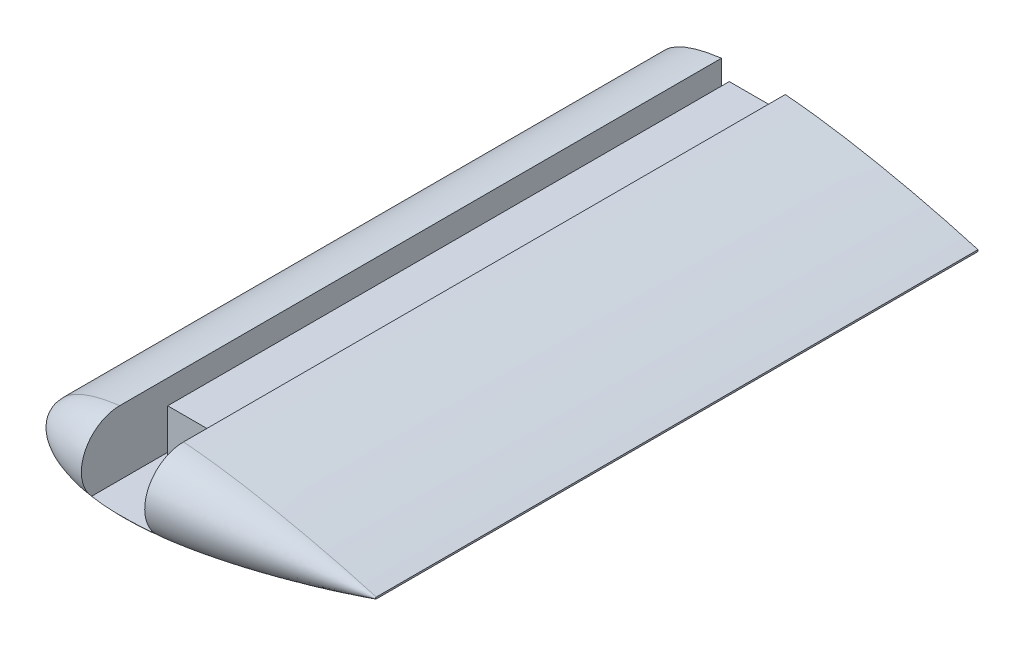
ISO-10303-21;
HEADER;
FILE_DESCRIPTION(('STEP AP214'),'2;1');
FILE_NAME('part.step','',(''),(''),'','','');
FILE_SCHEMA(('AUTOMOTIVE_DESIGN { 1 0 10303 214 1 1 1 1 }'));
ENDSEC;
DATA;
#1=APPLICATION_CONTEXT('core data for automotive mechanical design processes');
#2=APPLICATION_PROTOCOL_DEFINITION('international standard','automotive_design',2000,#1);
#3=PRODUCT_CONTEXT('',#1,'mechanical');
#4=PRODUCT('Part','Part','',(#3));
#5=PRODUCT_RELATED_PRODUCT_CATEGORY('part','',(#4));
#6=PRODUCT_DEFINITION_FORMATION('','',#4);
#7=PRODUCT_DEFINITION_CONTEXT('part definition',#1,'design');
#8=PRODUCT_DEFINITION('design','',#6,#7);
#9=PRODUCT_DEFINITION_SHAPE('','',#8);
#10=(LENGTH_UNIT() NAMED_UNIT(*) SI_UNIT(.MILLI.,.METRE.));
#11=(NAMED_UNIT(*) PLANE_ANGLE_UNIT() SI_UNIT($,.RADIAN.));
#12=(NAMED_UNIT(*) SI_UNIT($,.STERADIAN.) SOLID_ANGLE_UNIT());
#13=UNCERTAINTY_MEASURE_WITH_UNIT(LENGTH_MEASURE(1.E-05),#10,'distance_accuracy_value','');
#14=(GEOMETRIC_REPRESENTATION_CONTEXT(3) GLOBAL_UNCERTAINTY_ASSIGNED_CONTEXT((#13)) GLOBAL_UNIT_ASSIGNED_CONTEXT((#10,
#11,#12)) REPRESENTATION_CONTEXT('',''));
#15=CARTESIAN_POINT('',(0.,0.,0.));
#16=DIRECTION('',(0.,0.,1.));
#17=DIRECTION('',(1.,0.,0.));
#18=AXIS2_PLACEMENT_3D('',#15,#16,#17);
#19=CARTESIAN_POINT('',(-6.,-6.49999999999986,160.023665725905));
#20=DIRECTION('',(1.,0.,0.));
#21=DIRECTION('',(0.,1.,0.));
#22=AXIS2_PLACEMENT_3D('',#19,#20,#21);
#23=PLANE('',#22);
#24=DIRECTION('',(0.,1.,0.));
#25=VECTOR('',#24,1.);
#26=CARTESIAN_POINT('',(-6.,0.,140.));
#27=LINE('',#26,#25);
#28=CARTESIAN_POINT('',(-6.,-6.49999999999986,140.));
#29=VERTEX_POINT('',#28);
#30=CARTESIAN_POINT('',(-6.,5.50000000000014,140.));
#31=VERTEX_POINT('',#30);
#32=EDGE_CURVE('E142',#29,#31,#27,.T.);
#33=ORIENTED_EDGE('',*,*,#32,.T.);
#34=DIRECTION('',(0.,0.,-1.));
#35=VECTOR('',#34,1.);
#36=CARTESIAN_POINT('',(-6.,5.50000000000014,160.023665725905));
#37=LINE('',#36,#35);
#38=CARTESIAN_POINT('',(-6.,5.50000000000014,0.));
#39=VERTEX_POINT('',#38);
#40=EDGE_CURVE('E141',#31,#39,#37,.T.);
#41=ORIENTED_EDGE('',*,*,#40,.T.);
#42=DIRECTION('',(0.,-1.,0.));
#43=VECTOR('',#42,1.);
#44=CARTESIAN_POINT('',(-6.,-6.49999999999986,0.));
#45=LINE('',#44,#43);
#46=CARTESIAN_POINT('',(-6.,-6.49999999999986,0.));
#47=VERTEX_POINT('',#46);
#48=EDGE_CURVE('E276',#39,#47,#45,.T.);
#49=ORIENTED_EDGE('',*,*,#48,.T.);
#50=DIRECTION('',(0.,0.,-1.));
#51=VECTOR('',#50,1.);
#52=CARTESIAN_POINT('',(-6.,-6.49999999999986,160.023665725905));
#53=LINE('',#52,#51);
#54=EDGE_CURVE('E161',#29,#47,#53,.T.);
#55=ORIENTED_EDGE('',*,*,#54,.F.);
#56=EDGE_LOOP('',(#33,#41,#49,#55));
#57=FACE_BOUND('',#56,.T.);
#58=ADVANCED_FACE('F41',(#57),#23,.F.);
#59=CARTESIAN_POINT('',(6.,5.50000000000014,160.023665725905));
#60=DIRECTION('',(0.,-1.,0.));
#61=DIRECTION('',(1.,0.,0.));
#62=AXIS2_PLACEMENT_3D('',#59,#60,#61);
#63=PLANE('',#62);
#64=DIRECTION('',(1.,0.,0.));
#65=VECTOR('',#64,1.);
#66=CARTESIAN_POINT('',(0.,5.50000000000014,140.));
#67=LINE('',#66,#65);
#68=CARTESIAN_POINT('',(6.,5.50000000000014,140.));
#69=VERTEX_POINT('',#68);
#70=EDGE_CURVE('E130',#31,#69,#67,.T.);
#71=ORIENTED_EDGE('',*,*,#70,.T.);
#72=DIRECTION('',(0.,0.,-1.));
#73=VECTOR('',#72,1.);
#74=CARTESIAN_POINT('',(6.,5.50000000000014,160.023665725905));
#75=LINE('',#74,#73);
#76=CARTESIAN_POINT('',(6.,5.50000000000014,0.));
#77=VERTEX_POINT('',#76);
#78=EDGE_CURVE('E139',#69,#77,#75,.T.);
#79=ORIENTED_EDGE('',*,*,#78,.T.);
#80=DIRECTION('',(-1.,0.,0.));
#81=VECTOR('',#80,1.);
#82=CARTESIAN_POINT('',(6.,5.50000000000014,0.));
#83=LINE('',#82,#81);
#84=EDGE_CURVE('E163',#77,#39,#83,.T.);
#85=ORIENTED_EDGE('',*,*,#84,.T.);
#86=ORIENTED_EDGE('',*,*,#40,.F.);
#87=EDGE_LOOP('',(#71,#79,#85,#86));
#88=FACE_BOUND('',#87,.T.);
#89=ADVANCED_FACE('F137',(#88),#63,.F.);
#90=CARTESIAN_POINT('',(6.,-6.49999999999986,160.023665725905));
#91=DIRECTION('',(-1.,0.,0.));
#92=DIRECTION('',(0.,-1.,0.));
#93=AXIS2_PLACEMENT_3D('',#90,#91,#92);
#94=PLANE('',#93);
#95=DIRECTION('',(0.,-1.,0.));
#96=VECTOR('',#95,1.);
#97=CARTESIAN_POINT('',(6.,0.,140.));
#98=LINE('',#97,#96);
#99=CARTESIAN_POINT('',(6.,-6.49999999999986,140.));
#100=VERTEX_POINT('',#99);
#101=EDGE_CURVE('E127',#69,#100,#98,.T.);
#102=ORIENTED_EDGE('',*,*,#101,.T.);
#103=DIRECTION('',(0.,0.,-1.));
#104=VECTOR('',#103,1.);
#105=CARTESIAN_POINT('',(6.,-6.49999999999986,160.023665725905));
#106=LINE('',#105,#104);
#107=CARTESIAN_POINT('',(6.,-6.49999999999986,0.));
#108=VERTEX_POINT('',#107);
#109=EDGE_CURVE('E148',#100,#108,#106,.T.);
#110=ORIENTED_EDGE('',*,*,#109,.T.);
#111=DIRECTION('',(0.,1.,0.));
#112=VECTOR('',#111,1.);
#113=CARTESIAN_POINT('',(6.,-6.49999999999986,0.));
#114=LINE('',#113,#112);
#115=EDGE_CURVE('E146',#108,#77,#114,.T.);
#116=ORIENTED_EDGE('',*,*,#115,.T.);
#117=ORIENTED_EDGE('',*,*,#78,.F.);
#118=EDGE_LOOP('',(#102,#110,#116,#117));
#119=FACE_BOUND('',#118,.T.);
#120=ADVANCED_FACE('F144',(#119),#94,.F.);
#121=CARTESIAN_POINT('',(55.9989919193493,0.209938863085076,150.));
#122=CARTESIAN_POINT('',(53.4638964966378,0.950455213569446,150.));
#123=CARTESIAN_POINT('',(48.8039042583549,2.23387389684317,150.));
#124=CARTESIAN_POINT('',(42.4289239083546,3.81993488404164,150.));
#125=CARTESIAN_POINT('',(36.7433768309172,5.12087345257297,150.));
#126=CARTESIAN_POINT('',(31.199749361999,6.28724939568446,150.));
#127=CARTESIAN_POINT('',(25.282426202672,7.40748841907212,150.));
#128=CARTESIAN_POINT('',(20.1764843732921,8.24523101459941,150.));
#129=CARTESIAN_POINT('',(14.9796239544358,8.97488730570402,150.));
#130=CARTESIAN_POINT('',(10.821499068855,9.448623319597,150.));
#131=CARTESIAN_POINT('',(6.69735098701538,9.77702289368401,150.));
#132=CARTESIAN_POINT('',(3.68065560441313,9.9396226054484,150.));
#133=CARTESIAN_POINT('',(0.739619612666901,10.0126657259053,150.));
#134=CARTESIAN_POINT('',(-2.10775121270018,9.99002894364164,150.));
#135=CARTESIAN_POINT('',(-4.84394170477697,9.86696098204471,150.));
#136=CARTESIAN_POINT('',(-7.45218804783977,9.64089989695852,150.));
#137=CARTESIAN_POINT('',(-9.91647870541163,9.31063074400066,150.));
#138=CARTESIAN_POINT('',(-12.2217517660549,8.87722299298465,150.));
#139=CARTESIAN_POINT('',(-14.3540217517739,8.3436594333454,150.));
#140=CARTESIAN_POINT('',(-16.3004013447247,7.71434115945919,150.));
#141=CARTESIAN_POINT('',(-18.0493555178327,6.99539951409285,150.));
#142=CARTESIAN_POINT('',(-19.5906051636423,6.19339349001841,150.));
#143=CARTESIAN_POINT('',(-20.9154102376862,5.31556202706807,150.));
#144=CARTESIAN_POINT('',(-22.0158536973899,4.36806482887196,150.));
#145=CARTESIAN_POINT('',(-22.8849211839651,3.3564916522408,150.));
#146=CARTESIAN_POINT('',(-23.5144514570847,2.28497610959955,150.));
#147=CARTESIAN_POINT('',(-23.8953726240987,1.15878899111641,150.));
#148=CARTESIAN_POINT('',(-24.0186796636969,-1.75908521777257E-13,150.));
#149=CARTESIAN_POINT('',(-23.8953726240988,-1.15878899111675,150.));
#150=CARTESIAN_POINT('',(-23.5144514570847,-2.28497610959989,150.));
#151=CARTESIAN_POINT('',(-22.884921183965,-3.35649165224111,150.));
#152=CARTESIAN_POINT('',(-22.0158536973898,-4.36806482887224,150.));
#153=CARTESIAN_POINT('',(-20.915410237686,-5.3155620270683,150.));
#154=CARTESIAN_POINT('',(-19.5906051636421,-6.19339349001866,150.));
#155=CARTESIAN_POINT('',(-18.0493555178326,-6.99539951409303,150.));
#156=CARTESIAN_POINT('',(-16.3004013447245,-7.7143411594593,150.));
#157=CARTESIAN_POINT('',(-14.3540217517738,-8.34365943334548,150.));
#158=CARTESIAN_POINT('',(-12.2217517660546,-8.87722299298468,150.));
#159=CARTESIAN_POINT('',(-9.91647870541153,-9.31063074400058,150.));
#160=CARTESIAN_POINT('',(-7.45218804783928,-9.64089989695837,150.));
#161=CARTESIAN_POINT('',(-4.84394170477671,-9.86696098204449,150.));
#162=CARTESIAN_POINT('',(-2.10775121269992,-9.9900289436414,150.));
#163=CARTESIAN_POINT('',(0.739619612667124,-10.0126657259049,150.));
#164=CARTESIAN_POINT('',(3.68065560441341,-9.93962260544802,150.));
#165=CARTESIAN_POINT('',(7.74070186985012,-9.72078633967261,150.));
#166=CARTESIAN_POINT('',(12.9128329822487,-9.24133423758695,150.));
#167=CARTESIAN_POINT('',(19.1366713132933,-8.41575446947586,150.));
#168=CARTESIAN_POINT('',(25.2824253698515,-7.40744897655412,150.));
#169=CARTESIAN_POINT('',(31.1997526672966,-6.28725230429911,150.));
#170=CARTESIAN_POINT('',(37.5171609466784,-4.95809921986488,150.));
#171=CARTESIAN_POINT('',(44.7425708724751,-3.27585727198836,150.));
#172=CARTESIAN_POINT('',(51.057566094569,-1.62626062854624,150.));
#173=CARTESIAN_POINT('',(54.9450257220016,-0.517808616230064,150.));
#174=CARTESIAN_POINT('',(55.9579115196256,-0.221938690548135,150.));
#175=CARTESIAN_POINT('',(55.9989919193493,-0.209938863083146,150.));
#176=B_SPLINE_CURVE_WITH_KNOTS('',3,(#121,#122,#123,#124,#125,#126,#127,#128,#129,#130,#131,
#132,#133,#134,#135,#136,#137,#138,#139,#140,#141,#142,#143,#144,#145,#146,#147,#148,#149,#150,
#151,#152,#153,#154,#155,#156,#157,#158,#159,#160,#161,#162,#163,#164,#165,#166,#167,#168,#169,
#170,#171,#172,#173,#174,#175),.UNSPECIFIED.,.F.,.F.,(4,1,1,1,1,1,1,1,1,1,1,1,1,1,1,1,1,1,1,1,1,
1,1,1,1,1,1,1,1,1,1,1,1,1,1,1,1,1,1,1,1,1,1,1,1,1,1,1,1,1,1,1,4),(0.,0.046554702548103,
0.0851933723553801,0.115793222339596,0.149362634078918,0.1850479898127,0.221946042476896,
0.240561294663547,0.277549679499533,0.295701184971201,0.313482549842361,0.330796889450606,
0.347551895237421,0.36366584186233,0.379065349030513,0.393686065347915,0.407475418245897,
0.42039193375361,0.432405656844922,0.443502805927447,0.45368642125852,0.462984388050073,
0.471455944432899,0.479204464756735,0.48638826860332,0.493228973887645,0.5,0.506771026112355,
0.51361173139668,0.520795535243265,0.528544055567101,0.537015611949927,0.54631357874148,
0.556497194072553,0.567594343155078,0.579608066246389,0.592524581754103,0.606313934652085,
0.620934650969486,0.63633415813767,0.652448104762579,0.669203110549394,0.686517450157639,
0.704298815028799,0.740866340835607,0.778053957523103,0.8149520101873,0.850637365921082,
0.884206777660403,0.928744289385696,0.981399281225805,0.999245596133163,1.),.UNSPECIFIED.);
#177=DIRECTION('',(0.,0.,-1.));
#178=VECTOR('',#177,1.);
#179=SURFACE_OF_LINEAR_EXTRUSION('',#176,#178);
#180=CARTESIAN_POINT('',(55.9989919193493,0.209938863085076,0.));
#181=CARTESIAN_POINT('',(53.4638964966378,0.950455213569446,0.));
#182=CARTESIAN_POINT('',(48.8039042583549,2.23387389684317,0.));
#183=CARTESIAN_POINT('',(42.4289239083546,3.81993488404164,0.));
#184=CARTESIAN_POINT('',(36.7433768309172,5.12087345257297,0.));
#185=CARTESIAN_POINT('',(31.199749361999,6.28724939568446,0.));
#186=CARTESIAN_POINT('',(25.282426202672,7.40748841907212,0.));
#187=CARTESIAN_POINT('',(20.1764843732921,8.24523101459941,0.));
#188=CARTESIAN_POINT('',(14.9796239544358,8.97488730570402,0.));
#189=CARTESIAN_POINT('',(10.821499068855,9.448623319597,0.));
#190=CARTESIAN_POINT('',(6.69735098701538,9.77702289368401,0.));
#191=CARTESIAN_POINT('',(3.68065560441313,9.9396226054484,0.));
#192=CARTESIAN_POINT('',(0.739619612666901,10.0126657259053,0.));
#193=CARTESIAN_POINT('',(-2.10775121270018,9.99002894364164,0.));
#194=CARTESIAN_POINT('',(-4.84394170477697,9.86696098204471,0.));
#195=CARTESIAN_POINT('',(-7.45218804783977,9.64089989695852,0.));
#196=CARTESIAN_POINT('',(-9.91647870541163,9.31063074400066,0.));
#197=CARTESIAN_POINT('',(-12.2217517660549,8.87722299298465,0.));
#198=CARTESIAN_POINT('',(-14.3540217517739,8.3436594333454,0.));
#199=CARTESIAN_POINT('',(-16.3004013447247,7.71434115945919,0.));
#200=CARTESIAN_POINT('',(-18.0493555178327,6.99539951409285,0.));
#201=CARTESIAN_POINT('',(-19.5906051636423,6.19339349001841,0.));
#202=CARTESIAN_POINT('',(-20.9154102376862,5.31556202706807,0.));
#203=CARTESIAN_POINT('',(-22.0158536973899,4.36806482887196,0.));
#204=CARTESIAN_POINT('',(-22.8849211839651,3.3564916522408,0.));
#205=CARTESIAN_POINT('',(-23.5144514570847,2.28497610959955,0.));
#206=CARTESIAN_POINT('',(-23.8953726240987,1.15878899111641,0.));
#207=CARTESIAN_POINT('',(-24.0186796636969,-1.75908521777257E-13,0.));
#208=CARTESIAN_POINT('',(-23.8953726240988,-1.15878899111675,0.));
#209=CARTESIAN_POINT('',(-23.5144514570847,-2.28497610959989,0.));
#210=CARTESIAN_POINT('',(-22.884921183965,-3.35649165224111,0.));
#211=CARTESIAN_POINT('',(-22.0158536973898,-4.36806482887224,0.));
#212=CARTESIAN_POINT('',(-20.915410237686,-5.3155620270683,0.));
#213=CARTESIAN_POINT('',(-19.5906051636421,-6.19339349001866,0.));
#214=CARTESIAN_POINT('',(-18.0493555178326,-6.99539951409303,0.));
#215=CARTESIAN_POINT('',(-16.3004013447245,-7.7143411594593,0.));
#216=CARTESIAN_POINT('',(-14.3540217517738,-8.34365943334548,0.));
#217=CARTESIAN_POINT('',(-12.2217517660546,-8.87722299298468,0.));
#218=CARTESIAN_POINT('',(-9.91647870541153,-9.31063074400058,0.));
#219=CARTESIAN_POINT('',(-7.45218804783928,-9.64089989695837,0.));
#220=CARTESIAN_POINT('',(-4.84394170477671,-9.86696098204449,0.));
#221=CARTESIAN_POINT('',(-2.10775121269992,-9.9900289436414,0.));
#222=CARTESIAN_POINT('',(0.739619612667124,-10.0126657259049,0.));
#223=CARTESIAN_POINT('',(3.68065560441341,-9.93962260544802,0.));
#224=CARTESIAN_POINT('',(7.74070186985012,-9.72078633967261,0.));
#225=CARTESIAN_POINT('',(12.9128329822487,-9.24133423758695,0.));
#226=CARTESIAN_POINT('',(19.1366713132933,-8.41575446947586,0.));
#227=CARTESIAN_POINT('',(25.2824253698515,-7.40744897655412,0.));
#228=CARTESIAN_POINT('',(31.1997526672966,-6.28725230429911,0.));
#229=CARTESIAN_POINT('',(37.5171609466784,-4.95809921986488,0.));
#230=CARTESIAN_POINT('',(44.7425708724751,-3.27585727198836,0.));
#231=CARTESIAN_POINT('',(51.057566094569,-1.62626062854624,0.));
#232=CARTESIAN_POINT('',(54.9450257220016,-0.517808616230064,0.));
#233=CARTESIAN_POINT('',(55.9579115196256,-0.221938690548135,0.));
#234=CARTESIAN_POINT('',(55.9989919193493,-0.209938863083146,0.));
#235=B_SPLINE_CURVE_WITH_KNOTS('',3,(#180,#181,#182,#183,#184,#185,#186,#187,#188,#189,#190,
#191,#192,#193,#194,#195,#196,#197,#198,#199,#200,#201,#202,#203,#204,#205,#206,#207,#208,#209,
#210,#211,#212,#213,#214,#215,#216,#217,#218,#219,#220,#221,#222,#223,#224,#225,#226,#227,#228,
#229,#230,#231,#232,#233,#234),.UNSPECIFIED.,.F.,.F.,(4,1,1,1,1,1,1,1,1,1,1,1,1,1,1,1,1,1,1,1,1,
1,1,1,1,1,1,1,1,1,1,1,1,1,1,1,1,1,1,1,1,1,1,1,1,1,1,1,1,1,1,1,4),(0.,0.046554702548103,
0.0851933723553801,0.115793222339596,0.149362634078918,0.1850479898127,0.221946042476896,
0.240561294663547,0.277549679499533,0.295701184971201,0.313482549842361,0.330796889450606,
0.347551895237421,0.36366584186233,0.379065349030513,0.393686065347915,0.407475418245897,
0.42039193375361,0.432405656844922,0.443502805927447,0.45368642125852,0.462984388050073,
0.471455944432899,0.479204464756735,0.48638826860332,0.493228973887645,0.5,0.506771026112355,
0.51361173139668,0.520795535243265,0.528544055567101,0.537015611949927,0.54631357874148,
0.556497194072553,0.567594343155078,0.579608066246389,0.592524581754103,0.606313934652085,
0.620934650969486,0.63633415813767,0.652448104762579,0.669203110549394,0.686517450157639,
0.704298815028799,0.740866340835607,0.778053957523103,0.8149520101873,0.850637365921082,
0.884206777660403,0.928744289385696,0.981399281225805,0.999245596133163,1.),.UNSPECIFIED.);
#236=CARTESIAN_POINT('',(55.9989919193493,0.209938863085006,0.));
#237=VERTEX_POINT('',#236);
#238=CARTESIAN_POINT('',(7.95,9.67376392846105,0.));
#239=VERTEX_POINT('',#238);
#240=EDGE_CURVE('E233',#237,#239,#235,.T.);
#241=ORIENTED_EDGE('',*,*,#240,.T.);
#242=DIRECTION('',(0.,0.,-1.));
#243=VECTOR('',#242,1.);
#244=CARTESIAN_POINT('',(7.95,9.67376392846105,80.0118328629526));
#245=LINE('',#244,#243);
#246=CARTESIAN_POINT('',(7.95,9.67376392846105,150.000001847011));
#247=VERTEX_POINT('',#246);
#248=EDGE_CURVE('E157',#247,#239,#245,.T.);
#249=ORIENTED_EDGE('',*,*,#248,.F.);
#250=CARTESIAN_POINT('',(55.9989919193493,0.209938863085076,150.));
#251=CARTESIAN_POINT('',(55.1271411491385,0.464612250199043,150.));
#252=CARTESIAN_POINT('',(54.2539411662403,0.714650838260724,150.));
#253=CARTESIAN_POINT('',(52.5050353916493,1.20581723856216,150.));
#254=CARTESIAN_POINT('',(51.6293295930936,1.44694502637231,150.));
#255=CARTESIAN_POINT('',(49.8756060024761,1.92064822403817,150.));
#256=CARTESIAN_POINT('',(48.9975882009804,2.15322359893791,150.));
#257=CARTESIAN_POINT('',(47.2394229963136,2.61017265146479,150.));
#258=CARTESIAN_POINT('',(46.3592755959823,2.83454634002188,150.));
#259=CARTESIAN_POINT('',(44.5969774989975,3.27528514982476,150.));
#260=CARTESIAN_POINT('',(43.7148267997504,3.49165026069587,150.));
#261=CARTESIAN_POINT('',(41.9486556541519,3.91660985350397,150.));
#262=CARTESIAN_POINT('',(41.0646352066943,4.1252043308421,150.));
#263=CARTESIAN_POINT('',(39.294804875156,4.53465738122746,150.));
#264=CARTESIAN_POINT('',(38.408994991467,4.73551595596801,150.));
#265=CARTESIAN_POINT('',(36.635651455512,5.129479417883,150.));
#266=CARTESIAN_POINT('',(35.7481178016294,5.32258429778214,150.));
#267=CARTESIAN_POINT('',(33.971350682977,5.70081143652118,150.));
#268=CARTESIAN_POINT('',(33.0821172185141,5.88593369680148,150.));
#269=CARTESIAN_POINT('',(31.3019729938438,6.24794525016702,150.));
#270=CARTESIAN_POINT('',(30.4110622301832,6.42483452628265,150.));
#271=CARTESIAN_POINT('',(28.627550476294,6.76988145998508,150.));
#272=CARTESIAN_POINT('',(27.7349494876224,6.93803912561122,150.));
#273=CARTESIAN_POINT('',(25.9480403568048,7.26505116354927,150.));
#274=CARTESIAN_POINT('',(25.0537322101741,7.42390551138713,150.));
#275=CARTESIAN_POINT('',(23.263383729446,7.7315449476687,150.));
#276=CARTESIAN_POINT('',(22.3673433983912,7.88033005378308,150.));
#277=CARTESIAN_POINT('',(20.5734896681609,8.16678336697618,150.));
#278=CARTESIAN_POINT('',(19.675676281357,8.30445165134375,150.));
#279=CARTESIAN_POINT('',(17.8782551399905,8.56763850879303,150.));
#280=CARTESIAN_POINT('',(16.9786473659057,8.69315694894615,150.));
#281=CARTESIAN_POINT('',(15.1776358454113,8.93071782941879,150.));
#282=CARTESIAN_POINT('',(14.2762320762907,9.04276009821423,150.));
#283=CARTESIAN_POINT('',(12.4716579738219,9.25151809470306,150.));
#284=CARTESIAN_POINT('',(11.5684876840603,9.34823419583911,150.));
#285=CARTESIAN_POINT('',(9.76047177311674,9.52441734636588,150.));
#286=CARTESIAN_POINT('',(8.85562615087579,9.60388438485083,150.));
#287=CARTESIAN_POINT('',(7.95000000089382,9.67376392839216,150.));
#288=B_SPLINE_CURVE_WITH_KNOTS('',3,(#250,#251,#252,#253,#254,#255,#256,#257,#258,#259,#260,
#261,#262,#263,#264,#265,#266,#267,#268,#269,#270,#271,#272,#273,#274,#275,#276,#277,#278,#279,
#280,#281,#282,#283,#284,#285,#286,#287),.UNSPECIFIED.,.F.,.F.,(4,2,2,2,2,2,2,2,2,2,2,2,2,2,2,2,
2,2,4),(0.,2.72483676348229,5.44968099675121,8.17453636594376,10.8993881037371,13.6242433713088,
16.3491002514996,19.0739565352492,21.7988153756796,24.5236737244336,27.2485376893448,
29.9733991453782,32.698267769327,35.4231316112394,38.1479765071162,40.8728512115135,
43.597760594321,46.3226035708368,49.0474482701392),.UNSPECIFIED.);
#289=CARTESIAN_POINT('',(55.9989919193493,0.209938863085006,150.));
#290=VERTEX_POINT('',#289);
#291=EDGE_CURVE('E226',#290,#247,#288,.T.);
#292=ORIENTED_EDGE('',*,*,#291,.F.);
#293=DIRECTION('',(0.,0.,-1.));
#294=VECTOR('',#293,1.);
#295=CARTESIAN_POINT('',(55.9989919193493,0.209938863085006,150.));
#296=LINE('',#295,#294);
#297=EDGE_CURVE('E53',#290,#237,#296,.T.);
#298=ORIENTED_EDGE('',*,*,#297,.T.);
#299=EDGE_LOOP('',(#241,#249,#292,#298));
#300=FACE_BOUND('',#299,.T.);
#301=ADVANCED_FACE('F255',(#300),#179,.F.);
#302=CARTESIAN_POINT('',(-7.95,9.56370056967996,150.));
#303=CARTESIAN_POINT('',(-8.22753318357038,9.5305194512103,150.));
#304=CARTESIAN_POINT('',(-8.50480721761352,9.49513000922434,150.));
#305=CARTESIAN_POINT('',(-9.05871678310775,9.4196821738648,150.));
#306=CARTESIAN_POINT('',(-9.33535231860207,9.37962381013986,150.));
#307=CARTESIAN_POINT('',(-9.88787372676265,9.29458456304275,150.));
#308=CARTESIAN_POINT('',(-10.1637595843511,9.24960358140476,150.));
#309=CARTESIAN_POINT('',(-10.7146327073368,9.15441401677613,150.));
#310=CARTESIAN_POINT('',(-10.9896199646918,9.10420538712988,150.));
#311=CARTESIAN_POINT('',(-11.5385179860741,8.99821030489857,150.));
#312=CARTESIAN_POINT('',(-11.8124287570923,8.94242388859916,150.));
#313=CARTESIAN_POINT('',(-12.3589948574681,8.82495092634165,150.));
#314=CARTESIAN_POINT('',(-12.6316501440074,8.7632641806929,150.));
#315=CARTESIAN_POINT('',(-13.1754525345901,8.63355222782003,150.));
#316=CARTESIAN_POINT('',(-13.4465996410452,8.56552703073488,150.));
#317=CARTESIAN_POINT('',(-13.9871037709385,8.42268084764842,150.));
#318=CARTESIAN_POINT('',(-14.256460783671,8.34785982104371,150.));
#319=CARTESIAN_POINT('',(-14.7930698589509,8.19095568475713,150.));
#320=CARTESIAN_POINT('',(-15.0603218326613,8.10887227035715,150.));
#321=CARTESIAN_POINT('',(-15.5922723863722,7.93680557095157,150.));
#322=CARTESIAN_POINT('',(-15.8569710115068,7.84682242587031,150.));
#323=CARTESIAN_POINT('',(-16.3833653336106,7.65838914626618,150.));
#324=CARTESIAN_POINT('',(-16.6450608427452,7.55993848536609,150.));
#325=CARTESIAN_POINT('',(-17.1647821212615,7.35376145834713,150.));
#326=CARTESIAN_POINT('',(-17.4228079240815,7.24603517681107,150.));
#327=CARTESIAN_POINT('',(-17.934441943273,7.02048572927127,150.));
#328=CARTESIAN_POINT('',(-18.1880499343735,6.90266205018876,150.));
#329=CARTESIAN_POINT('',(-18.6898449119053,6.6559369053752,150.));
#330=CARTESIAN_POINT('',(-18.9380317615765,6.52703516057982,150.));
#331=CARTESIAN_POINT('',(-19.4277385965644,6.25700908423786,150.));
#332=CARTESIAN_POINT('',(-19.6692582136517,6.11588407937823,150.));
#333=CARTESIAN_POINT('',(-20.0252798816856,5.89415170396346,150.));
#334=CARTESIAN_POINT('',(-20.1429213728065,5.81855933220771,150.));
#335=CARTESIAN_POINT('',(-20.3758363089852,5.66381295778904,150.));
#336=CARTESIAN_POINT('',(-20.4911098884846,5.58465915814997,150.));
#337=CARTESIAN_POINT('',(-20.7190136192923,5.42261638183241,150.));
#338=CARTESIAN_POINT('',(-20.8316436224775,5.33972719661141,150.));
#339=CARTESIAN_POINT('',(-21.0539650831813,5.17004322724579,150.));
#340=CARTESIAN_POINT('',(-21.1636559235778,5.08324763298492,150.));
#341=CARTESIAN_POINT('',(-21.3796614093808,4.90554784199894,150.));
#342=CARTESIAN_POINT('',(-21.4859761223436,4.81464372757365,150.));
#343=CARTESIAN_POINT('',(-21.6947707878744,4.6285347992956,150.));
#344=CARTESIAN_POINT('',(-21.7972509248309,4.53333019272246,150.));
#345=CARTESIAN_POINT('',(-21.9979255621844,4.33844525143407,150.));
#346=CARTESIAN_POINT('',(-22.0961189457864,4.23876376395221,150.));
#347=CARTESIAN_POINT('',(-22.2876266989927,4.03478642548353,150.));
#348=CARTESIAN_POINT('',(-22.380940441701,3.93048998476773,150.));
#349=CARTESIAN_POINT('',(-22.5619894157365,3.71716055020745,150.));
#350=CARTESIAN_POINT('',(-22.6497253795404,3.60812818146598,150.));
#351=CARTESIAN_POINT('',(-22.7765949980046,3.44099138300647,150.));
#352=CARTESIAN_POINT('',(-22.8180995991509,3.38467545908332,150.));
#353=CARTESIAN_POINT('',(-22.8994479130284,3.27082969454604,150.));
#354=CARTESIAN_POINT('',(-22.9392911581228,3.21329951891799,150.));
#355=CARTESIAN_POINT('',(-23.0172139711376,3.09704424721178,150.));
#356=CARTESIAN_POINT('',(-23.0552932772509,3.03831897560522,150.));
#357=CARTESIAN_POINT('',(-23.1295816452798,2.91969806567957,150.));
#358=CARTESIAN_POINT('',(-23.1657907528149,2.85980245595764,150.));
#359=CARTESIAN_POINT('',(-23.236231664596,2.73886607678909,150.));
#360=CARTESIAN_POINT('',(-23.2704636520635,2.67782541415235,150.));
#361=CARTESIAN_POINT('',(-23.3368437583554,2.55462422276494,150.));
#362=CARTESIAN_POINT('',(-23.3689919808748,2.49246374993681,150.));
#363=CARTESIAN_POINT('',(-23.4310975820371,2.36704799156275,150.));
#364=CARTESIAN_POINT('',(-23.4610547148085,2.3037925841315,150.));
#365=CARTESIAN_POINT('',(-23.5186702146848,2.17622133347108,150.));
#366=CARTESIAN_POINT('',(-23.5463279367824,2.1119051987199,150.));
#367=CARTESIAN_POINT('',(-23.5992686772803,1.98229221637418,150.));
#368=CARTESIAN_POINT('',(-23.6245513711086,1.91699523614724,150.));
#369=CARTESIAN_POINT('',(-23.6726617338773,1.78550429741383,150.));
#370=CARTESIAN_POINT('',(-23.69548946644,1.71931036220274,150.));
#371=CARTESIAN_POINT('',(-23.7386094350511,1.58610953124288,150.));
#372=CARTESIAN_POINT('',(-23.7589019620377,1.51910272974805,150.));
#373=CARTESIAN_POINT('',(-23.7968739910557,1.38436078238919,150.));
#374=CARTESIAN_POINT('',(-23.8145538120162,1.31662572650671,150.));
#375=CARTESIAN_POINT('',(-23.8472122456664,1.18050981898531,150.));
#376=CARTESIAN_POINT('',(-23.8621909702651,1.1121289942248,150.));
#377=CARTESIAN_POINT('',(-23.8894093555241,0.974819892497791,150.));
#378=CARTESIAN_POINT('',(-23.9016488345141,0.905891579534924,150.));
#379=CARTESIAN_POINT('',(-23.923401922617,0.767598592354295,150.));
#380=CARTESIAN_POINT('',(-23.9329152240276,0.698233869781492,150.));
#381=CARTESIAN_POINT('',(-23.9492180688826,0.559176751193732,150.));
#382=CARTESIAN_POINT('',(-23.9560072829074,0.489484316579443,150.));
#383=CARTESIAN_POINT('',(-23.9668669138182,0.349881184363073,150.));
#384=CARTESIAN_POINT('',(-23.970937059259,0.279970465669357,150.));
#385=CARTESIAN_POINT('',(-23.9763625658432,0.140039719535395,150.));
#386=CARTESIAN_POINT('',(-23.9777177723866,0.070019686097512,150.));
#387=CARTESIAN_POINT('',(-23.9777178269785,-7.19950622160723E-12,150.));
#388=B_SPLINE_CURVE_WITH_KNOTS('',3,(#302,#303,#304,#305,#306,#307,#308,#309,#310,#311,#312,
#313,#314,#315,#316,#317,#318,#319,#320,#321,#322,#323,#324,#325,#326,#327,#328,#329,#330,#331,
#332,#333,#334,#335,#336,#337,#338,#339,#340,#341,#342,#343,#344,#345,#346,#347,#348,#349,#350,
#351,#352,#353,#354,#355,#356,#357,#358,#359,#360,#361,#362,#363,#364,#365,#366,#367,#368,#369,
#370,#371,#372,#373,#374,#375,#376,#377,#378,#379,#380,#381,#382,#383,#384,#385,#386,#387),
.UNSPECIFIED.,.F.,.F.,(4,2,2,2,2,2,2,2,2,2,2,2,2,2,2,2,2,2,2,2,2,2,2,2,2,2,2,2,2,2,2,2,2,2,2,2,
2,2,2,2,2,2,4),(0.,0.838527298035833,1.67704927153676,2.51558798675702,3.3541341863935,
4.19267493132004,5.03124406585467,5.86981185904101,6.70838466279221,7.54699266841038,
8.3855858231418,9.2242311461645,10.0628688225332,10.9015491378692,11.7402505863526,
12.5789982637636,12.9984494814631,13.4178768180187,13.8373275998247,14.2568657723491,
14.6763955446158,15.0959051174788,15.5155233375821,15.9351953349899,16.3548121065272,
16.5646610634578,16.7745686951112,16.9845073824585,17.1944409463631,17.4043550242114,
17.614258647997,17.8241857899281,18.0341716211842,18.2441861075342,18.45419514988,
18.6641800695704,18.8741393355099,19.0840899006377,19.2940543858294,19.5040425602665,
19.7140561205875,19.9240906434755,20.1341371262689),.UNSPECIFIED.);
#389=CARTESIAN_POINT('',(-7.94999999999999,9.56370056967996,150.));
#390=VERTEX_POINT('',#389);
#391=CARTESIAN_POINT('',(-23.9777178269785,7.19443308128715E-12,150.));
#392=VERTEX_POINT('',#391);
#393=EDGE_CURVE('E204',#390,#392,#388,.T.);
#394=ORIENTED_EDGE('',*,*,#393,.F.);
#395=DIRECTION('',(0.,0.,-1.));
#396=VECTOR('',#395,1.);
#397=CARTESIAN_POINT('',(-7.94999999999999,9.56370056967996,80.0118328629526));
#398=LINE('',#397,#396);
#399=CARTESIAN_POINT('',(-7.94999999999999,9.56370056967996,0.));
#400=VERTEX_POINT('',#399);
#401=EDGE_CURVE('E160',#390,#400,#398,.T.);
#402=ORIENTED_EDGE('',*,*,#401,.T.);
#403=CARTESIAN_POINT('',(55.9989919193493,-0.209938863083216,0.));
#404=VERTEX_POINT('',#403);
#405=EDGE_CURVE('E236',#400,#404,#235,.T.);
#406=ORIENTED_EDGE('',*,*,#405,.T.);
#407=DIRECTION('',(0.,0.,-1.));
#408=VECTOR('',#407,1.);
#409=CARTESIAN_POINT('',(55.9989919193493,-0.209938863083216,150.));
#410=LINE('',#409,#408);
#411=CARTESIAN_POINT('',(55.9989919193493,-0.209938863083216,150.));
#412=VERTEX_POINT('',#411);
#413=EDGE_CURVE('E11',#412,#404,#410,.T.);
#414=ORIENTED_EDGE('',*,*,#413,.F.);
#415=CARTESIAN_POINT('',(-23.9777178269785,7.19443308128715E-12,150.));
#416=CARTESIAN_POINT('',(-23.9777177695293,-0.0683302230381318,150.));
#417=CARTESIAN_POINT('',(-23.9764271730819,-0.136660760596562,150.));
#418=CARTESIAN_POINT('',(-23.9712604369583,-0.273220239356384,150.));
#419=CARTESIAN_POINT('',(-23.9673844379123,-0.341449185881419,150.));
#420=CARTESIAN_POINT('',(-23.9570429280614,-0.477704180211619,150.));
#421=CARTESIAN_POINT('',(-23.9505776655341,-0.545730246840516,150.));
#422=CARTESIAN_POINT('',(-23.9350530331009,-0.681477804150576,150.));
#423=CARTESIAN_POINT('',(-23.925993967869,-0.749199329655432,150.));
#424=CARTESIAN_POINT('',(-23.9052793474593,-0.884236635971772,150.));
#425=CARTESIAN_POINT('',(-23.8936240841898,-0.951552461525614,150.));
#426=CARTESIAN_POINT('',(-23.867706759607,-1.08567558788937,150.));
#427=CARTESIAN_POINT('',(-23.8534448894775,-1.15248292562066,150.));
#428=CARTESIAN_POINT('',(-23.8223375316178,-1.28549450462081,150.));
#429=CARTESIAN_POINT('',(-23.8054919833867,-1.35169873172841,150.));
#430=CARTESIAN_POINT('',(-23.7693002567484,-1.48342729019541,150.));
#431=CARTESIAN_POINT('',(-23.7499537979033,-1.54895154441498,150.));
#432=CARTESIAN_POINT('',(-23.7088321803565,-1.67924156539254,150.));
#433=CARTESIAN_POINT('',(-23.6870567301177,-1.7440072400697,150.));
#434=CARTESIAN_POINT('',(-23.6411513521556,-1.87270180722926,150.));
#435=CARTESIAN_POINT('',(-23.6170213050986,-1.93663065711399,150.));
#436=CARTESIAN_POINT('',(-23.5664815257901,-2.06357380729059,150.));
#437=CARTESIAN_POINT('',(-23.5400719957384,-2.12658818812175,150.));
#438=CARTESIAN_POINT('',(-23.4850416001654,-2.25162364156624,150.));
#439=CARTESIAN_POINT('',(-23.4564213136616,-2.31364496916633,150.));
#440=CARTESIAN_POINT('',(-23.3970622196087,-2.43665109014874,150.));
#441=CARTESIAN_POINT('',(-23.3663237817694,-2.49763606211553,150.));
#442=CARTESIAN_POINT('',(-23.3028310967752,-2.61854740622786,150.));
#443=CARTESIAN_POINT('',(-23.2700768250553,-2.67847376546169,150.));
#444=CARTESIAN_POINT('',(-23.2026510826304,-2.79724422421851,150.));
#445=CARTESIAN_POINT('',(-23.1679794411229,-2.85608822669918,150.));
#446=CARTESIAN_POINT('',(-23.0968183921628,-2.97267046890269,150.));
#447=CARTESIAN_POINT('',(-23.0603288751151,-3.03040864166669,150.));
#448=CARTESIAN_POINT('',(-22.9856307792627,-3.1447562076902,150.));
#449=CARTESIAN_POINT('',(-22.9474223169795,-3.20136567708632,150.));
#450=CARTESIAN_POINT('',(-22.8693846897675,-3.31343182429571,150.));
#451=CARTESIAN_POINT('',(-22.8295559422293,-3.36888879350453,150.));
#452=CARTESIAN_POINT('',(-22.7077748733514,-3.53352191452743,150.));
#453=CARTESIAN_POINT('',(-22.6235051587953,-3.6409946694965,150.));
#454=CARTESIAN_POINT('',(-22.4494938822564,-3.85140841520377,150.));
#455=CARTESIAN_POINT('',(-22.3597517695243,-3.95434894801209,150.));
#456=CARTESIAN_POINT('',(-22.1754417207865,-4.15580441970164,150.));
#457=CARTESIAN_POINT('',(-22.0808738335063,-4.25431940324863,150.));
#458=CARTESIAN_POINT('',(-21.887515223762,-4.44704228137104,150.));
#459=CARTESIAN_POINT('',(-21.7887258171718,-4.54125149940267,150.));
#460=CARTESIAN_POINT('',(-21.5873594500132,-4.72551900874703,150.));
#461=CARTESIAN_POINT('',(-21.484782567032,-4.81557738500561,150.));
#462=CARTESIAN_POINT('',(-21.2762654476657,-4.99171909657066,150.));
#463=CARTESIAN_POINT('',(-21.1703249753459,-5.07780215198911,150.));
#464=CARTESIAN_POINT('',(-20.955505559802,-5.2461795012562,150.));
#465=CARTESIAN_POINT('',(-20.8466270475989,-5.32847434610721,150.));
#466=CARTESIAN_POINT('',(-20.626253385101,-5.48944505763071,150.));
#467=CARTESIAN_POINT('',(-20.5147586086955,-5.56812143671698,150.));
#468=CARTESIAN_POINT('',(-20.2894056971264,-5.72201130134387,150.));
#469=CARTESIAN_POINT('',(-20.1755474783828,-5.79722466411572,150.));
#470=CARTESIAN_POINT('',(-19.8308434668685,-6.01794326928441,150.));
#471=CARTESIAN_POINT('',(-19.5968429107286,-6.15854541682886,150.));
#472=CARTESIAN_POINT('',(-19.1221921724692,-6.42787273972945,150.));
#473=CARTESIAN_POINT('',(-18.8815427369845,-6.55659924167178,150.));
#474=CARTESIAN_POINT('',(-18.3947543745223,-6.8031930827647,150.));
#475=CARTESIAN_POINT('',(-18.148615342158,-6.92106021321851,150.));
#476=CARTESIAN_POINT('',(-17.6519080483474,-7.14695619095829,150.));
#477=CARTESIAN_POINT('',(-17.4013401846348,-7.25498591639111,150.));
#478=CARTESIAN_POINT('',(-16.8964767357178,-7.46194191074438,150.));
#479=CARTESIAN_POINT('',(-16.6421810445279,-7.5608679202537,150.));
#480=CARTESIAN_POINT('',(-16.1305484090542,-7.75043755185547,150.));
#481=CARTESIAN_POINT('',(-15.8732116639685,-7.84108171307449,150.));
#482=CARTESIAN_POINT('',(-15.3559561643097,-8.01463846585032,150.));
#483=CARTESIAN_POINT('',(-15.096037408061,-8.0975510523894,150.));
#484=CARTESIAN_POINT('',(-14.313070621505,-8.33559277672073,150.));
#485=CARTESIAN_POINT('',(-13.7867551948683,-8.4800466205537,150.));
#486=CARTESIAN_POINT('',(-12.728031121152,-8.7441366386503,150.));
#487=CARTESIAN_POINT('',(-12.1956224557503,-8.86377273826702,150.));
#488=CARTESIAN_POINT('',(-11.1264088011779,-9.08125812241895,150.));
#489=CARTESIAN_POINT('',(-10.5896038505638,-9.17910759781651,150.));
#490=CARTESIAN_POINT('',(-9.51286379415082,-9.35546216373331,150.));
#491=CARTESIAN_POINT('',(-8.97292872854633,-9.43396750209291,150.));
#492=CARTESIAN_POINT('',(-7.89084132329264,-9.5736479334977,150.));
#493=CARTESIAN_POINT('',(-7.34868898199764,-9.63482301367697,150.));
#494=CARTESIAN_POINT('',(-6.26287267461823,-9.7415953551371,150.));
#495=CARTESIAN_POINT('',(-5.71920871876638,-9.78719272161055,150.));
#496=CARTESIAN_POINT('',(-4.63090127583314,-9.86433373983839,150.));
#497=CARTESIAN_POINT('',(-4.08625779697379,-9.89587750901003,150.));
#498=CARTESIAN_POINT('',(-2.99638959077681,-9.94616459247846,150.));
#499=CARTESIAN_POINT('',(-2.45116486341522,-9.96490790624739,150.));
#500=CARTESIAN_POINT('',(-1.36045196401945,-9.99073560660965,150.));
#501=CARTESIAN_POINT('',(-0.814963794439343,-9.99782009979053,150.));
#502=CARTESIAN_POINT('',(0.276040502880011,-10.001319964273,150.));
#503=CARTESIAN_POINT('',(0.821556630612651,-9.99773533808354,150.));
#504=CARTESIAN_POINT('',(1.91242938446476,-9.98080459639361,150.));
#505=CARTESIAN_POINT('',(2.45778601142747,-9.96745853346827,150.));
#506=CARTESIAN_POINT('',(3.54820008052044,-9.93179224865063,150.));
#507=CARTESIAN_POINT('',(4.09325752353844,-9.90947205353236,150.));
#508=CARTESIAN_POINT('',(5.18296654651559,-9.85656577384727,150.));
#509=CARTESIAN_POINT('',(5.72761812730261,-9.82597970618741,150.));
#510=CARTESIAN_POINT('',(6.81643499396208,-9.75719166437859,150.));
#511=CARTESIAN_POINT('',(7.36060028192293,-9.71898972309552,150.));
#512=CARTESIAN_POINT('',(8.4483843367055,-9.63553687348112,150.));
#513=CARTESIAN_POINT('',(8.99200310684279,-9.59028600817672,150.));
#514=CARTESIAN_POINT('',(10.0786505689088,-9.49327897385461,150.));
#515=CARTESIAN_POINT('',(10.6216792687188,-9.44152289282954,150.));
#516=CARTESIAN_POINT('',(11.7071234036381,-9.33192878759695,150.));
#517=CARTESIAN_POINT('',(12.2495388361831,-9.27409073805188,150.));
#518=CARTESIAN_POINT('',(13.3337423882329,-9.15273578325955,150.));
#519=CARTESIAN_POINT('',(13.8755304964476,-9.08921877736587,150.));
#520=CARTESIAN_POINT('',(14.9584659255824,-8.95691449473288,150.));
#521=CARTESIAN_POINT('',(15.4996132412718,-8.88812717526899,150.));
#522=CARTESIAN_POINT('',(16.5812592136704,-8.74568633531258,150.));
#523=CARTESIAN_POINT('',(17.1217578783224,-8.67203287503857,150.));
#524=CARTESIAN_POINT('',(18.2021046062991,-8.52014342724335,150.));
#525=CARTESIAN_POINT('',(18.7419526761342,-8.44190748597362,150.));
#526=CARTESIAN_POINT('',(19.8210035016819,-8.28113256142829,150.));
#527=CARTESIAN_POINT('',(20.3602062614693,-8.19859360547232,150.));
#528=CARTESIAN_POINT('',(21.4379714442614,-8.02942929928282,150.));
#529=CARTESIAN_POINT('',(21.9765338654276,-7.94280393734558,150.));
#530=CARTESIAN_POINT('',(23.0530251648853,-7.76568532220017,150.));
#531=CARTESIAN_POINT('',(23.5909540392659,-7.67519204524346,150.));
#532=CARTESIAN_POINT('',(24.66618598485,-7.4905610596023,150.));
#533=CARTESIAN_POINT('',(25.203489055492,-7.39642334765161,150.));
#534=CARTESIAN_POINT('',(26.2774773488187,-7.20470271685286,150.));
#535=CARTESIAN_POINT('',(26.8141625742796,-7.10711981354869,150.));
#536=CARTESIAN_POINT('',(27.8869171980562,-6.90862804270891,150.));
#537=CARTESIAN_POINT('',(28.4229865965864,-6.80771917633195,150.));
#538=CARTESIAN_POINT('',(29.4945138889206,-6.60270314735609,150.));
#539=CARTESIAN_POINT('',(30.0299717819465,-6.49859598069254,150.));
#540=CARTESIAN_POINT('',(31.1002818092814,-6.28731686383907,150.));
#541=CARTESIAN_POINT('',(31.6351339441845,-6.18014491665742,150.));
#542=CARTESIAN_POINT('',(32.7042325397408,-5.96282680618127,150.));
#543=CARTESIAN_POINT('',(33.2384790014582,-5.85268064812083,150.));
#544=CARTESIAN_POINT('',(34.3063610893734,-5.62946657207584,150.));
#545=CARTESIAN_POINT('',(34.8399967155949,-5.51639865420488,150.));
#546=CARTESIAN_POINT('',(35.9066538045548,-5.28740227280868,150.));
#547=CARTESIAN_POINT('',(36.439675267209,-5.17147380889146,150.));
#548=CARTESIAN_POINT('',(37.5051002184032,-4.93681322567505,150.));
#549=CARTESIAN_POINT('',(38.0375037074046,-4.8180811084707,150.));
#550=CARTESIAN_POINT('',(39.1016785582767,-4.57781812414794,150.));
#551=CARTESIAN_POINT('',(39.633449920436,-4.45628725830753,150.));
#552=CARTESIAN_POINT('',(40.6963465451776,-4.21043197466644,150.));
#553=CARTESIAN_POINT('',(41.2274718076554,-4.08610755641413,150.));
#554=CARTESIAN_POINT('',(42.2890631581678,-3.83467445820414,150.));
#555=CARTESIAN_POINT('',(42.8195292459293,-3.70756577709309,150.));
#556=CARTESIAN_POINT('',(43.8797764792727,-3.45052435193015,150.));
#557=CARTESIAN_POINT('',(44.4095576253296,-3.32059160983756,150.));
#558=CARTESIAN_POINT('',(45.4684071001918,-3.05785556157067,150.));
#559=CARTESIAN_POINT('',(45.9974754297967,-2.92505225861883,150.));
#560=CARTESIAN_POINT('',(47.0548716234209,-2.65652958756564,150.));
#561=CARTESIAN_POINT('',(47.5831994874742,-2.5208102195977,150.));
#562=CARTESIAN_POINT('',(48.6390873506176,-2.24641272669028,150.));
#563=CARTESIAN_POINT('',(49.1666473484568,-2.10773459693659,150.));
#564=CARTESIAN_POINT('',(50.2209606052418,-1.82734602432848,150.));
#565=CARTESIAN_POINT('',(50.7477138648923,-1.68563558412442,150.));
#566=CARTESIAN_POINT('',(51.8003719773376,-1.39910387947013,150.));
#567=CARTESIAN_POINT('',(52.3262768328294,-1.25428262492999,150.));
#568=CARTESIAN_POINT('',(53.3771969504395,-0.961452131428205,150.));
#569=CARTESIAN_POINT('',(53.9022122149747,-0.813442901142548,150.));
#570=CARTESIAN_POINT('',(54.9513114651706,-0.51415909461988,150.));
#571=CARTESIAN_POINT('',(55.4753954502702,-0.362884516416477,150.));
#572=CARTESIAN_POINT('',(55.9989919193493,-0.209938863085076,150.));
#573=B_SPLINE_CURVE_WITH_KNOTS('',3,(#415,#416,#417,#418,#419,#420,#421,#422,#423,#424,#425,
#426,#427,#428,#429,#430,#431,#432,#433,#434,#435,#436,#437,#438,#439,#440,#441,#442,#443,#444,
#445,#446,#447,#448,#449,#450,#451,#452,#453,#454,#455,#456,#457,#458,#459,#460,#461,#462,#463,
#464,#465,#466,#467,#468,#469,#470,#471,#472,#473,#474,#475,#476,#477,#478,#479,#480,#481,#482,
#483,#484,#485,#486,#487,#488,#489,#490,#491,#492,#493,#494,#495,#496,#497,#498,#499,#500,#501,
#502,#503,#504,#505,#506,#507,#508,#509,#510,#511,#512,#513,#514,#515,#516,#517,#518,#519,#520,
#521,#522,#523,#524,#525,#526,#527,#528,#529,#530,#531,#532,#533,#534,#535,#536,#537,#538,#539,
#540,#541,#542,#543,#544,#545,#546,#547,#548,#549,#550,#551,#552,#553,#554,#555,#556,#557,#558,
#559,#560,#561,#562,#563,#564,#565,#566,#567,#568,#569,#570,#571,#572),.UNSPECIFIED.,.F.,.F.,(4,
2,2,2,2,2,2,2,2,2,2,2,2,2,2,2,2,2,2,2,2,2,2,2,2,2,2,2,2,2,2,2,2,2,2,2,2,2,2,2,2,2,2,2,2,2,2,2,2,
2,2,2,2,2,2,2,2,2,2,2,2,2,2,2,2,2,2,2,2,2,2,2,2,2,2,2,2,2,4),(0.,0.204978970230332,
0.409946791745482,0.614894964153298,0.819819072760209,1.02472015197392,1.22960620857031,
1.43449706362972,1.63941091395547,1.84434938538154,2.04929824872819,2.25422895087609,
2.45910616058103,2.66394770040175,2.86879173691497,3.07365405075422,3.27852873019672,
3.48338954275404,3.68819791261087,4.09769143435875,4.5072262362964,4.91675690399187,
5.32616083651484,5.73555638697588,6.14498071769324,6.55434530747231,6.96365174718381,
7.37297268622563,8.19152061846543,9.00997700262447,9.82844911270273,10.646848089194,
11.4652703788152,12.2836393532794,13.1020088588553,14.7385665042156,16.3751290719499,
18.0116773019663,19.6482045631586,21.2847330393001,22.9212504641379,24.557754215683,
26.1942580347158,27.8307468923804,29.4672353652022,31.1037150239525,32.7401898003553,
34.3766612295472,36.0131255967859,37.649579975373,39.286012220887,40.9224512840629,
42.5589193550993,44.195400693813,45.8318617848585,47.4683063617688,49.1047405502383,
50.7411794258359,52.377628350423,54.0140787416803,55.6505217506051,57.2869641894568,
58.923408708106,60.5598516205355,62.1962916533139,63.8327316224751,65.4691718158821,
67.1056107865992,68.7420490100756,70.3784874981176,72.0149266640625,73.6513646947108,
75.2878008884129,76.9242370072493,78.5606757889319,80.1971131403631,81.8335452793918,
83.4699729654787,85.1064016370499),.UNSPECIFIED.);
#574=EDGE_CURVE('E209',#392,#412,#573,.T.);
#575=ORIENTED_EDGE('',*,*,#574,.F.);
#576=EDGE_LOOP('',(#394,#402,#406,#414,#575));
#577=FACE_BOUND('',#576,.T.);
#578=ADVANCED_FACE('F43',(#577),#179,.F.);
#579=CARTESIAN_POINT('',(55.9989919193493,0.209938863085006,150.));
#580=DIRECTION('',(-1.,0.,0.));
#581=DIRECTION('',(0.,0.,1.));
#582=AXIS2_PLACEMENT_3D('',#579,#580,#581);
#583=PLANE('',#582);
#584=DIRECTION('',(0.,1.,0.));
#585=VECTOR('',#584,1.);
#586=CARTESIAN_POINT('',(55.9989919193493,0.209938863085006,0.));
#587=LINE('',#586,#585);
#588=EDGE_CURVE('E232',#404,#237,#587,.T.);
#589=ORIENTED_EDGE('',*,*,#588,.T.);
#590=ORIENTED_EDGE('',*,*,#297,.F.);
#591=CARTESIAN_POINT('',(55.9989919193493,0.,150.));
#592=DIRECTION('',(-1.,0.,0.));
#593=DIRECTION('',(0.,-1.,0.));
#594=AXIS2_PLACEMENT_3D('',#591,#592,#593);
#595=CIRCLE('',#594,0.209938863085076);
#596=EDGE_CURVE('E150',#412,#290,#595,.T.);
#597=ORIENTED_EDGE('',*,*,#596,.F.);
#598=ORIENTED_EDGE('',*,*,#413,.T.);
#599=EDGE_LOOP('',(#589,#590,#597,#598));
#600=FACE_BOUND('',#599,.T.);
#601=ADVANCED_FACE('F254',(#600),#583,.F.);
#602=CARTESIAN_POINT('',(-23.9777178269784,-1.93472177114595E-13,0.));
#603=DIRECTION('',(0.,0.,-1.));
#604=DIRECTION('',(-1.,0.,0.));
#605=AXIS2_PLACEMENT_3D('',#602,#603,#604);
#606=PLANE('',#605);
#607=DIRECTION('',(0.,-1.,0.));
#608=VECTOR('',#607,1.);
#609=CARTESIAN_POINT('',(7.95,-6.49999999999986,0.));
#610=LINE('',#609,#608);
#611=CARTESIAN_POINT('',(7.95,-6.49999999999986,0.));
#612=VERTEX_POINT('',#611);
#613=EDGE_CURVE('E260',#239,#612,#610,.T.);
#614=ORIENTED_EDGE('',*,*,#613,.F.);
#615=ORIENTED_EDGE('',*,*,#240,.F.);
#616=ORIENTED_EDGE('',*,*,#588,.F.);
#617=ORIENTED_EDGE('',*,*,#405,.F.);
#618=DIRECTION('',(0.,1.,0.));
#619=VECTOR('',#618,1.);
#620=CARTESIAN_POINT('',(-7.95,-6.49999999999986,0.));
#621=LINE('',#620,#619);
#622=CARTESIAN_POINT('',(-7.95,-6.49999999999986,0.));
#623=VERTEX_POINT('',#622);
#624=EDGE_CURVE('E266',#623,#400,#621,.T.);
#625=ORIENTED_EDGE('',*,*,#624,.F.);
#626=DIRECTION('',(-1.,0.,0.));
#627=VECTOR('',#626,1.);
#628=CARTESIAN_POINT('',(-6.,-6.49999999999986,0.));
#629=LINE('',#628,#627);
#630=EDGE_CURVE('E269',#47,#623,#629,.T.);
#631=ORIENTED_EDGE('',*,*,#630,.F.);
#632=ORIENTED_EDGE('',*,*,#48,.F.);
#633=ORIENTED_EDGE('',*,*,#84,.F.);
#634=ORIENTED_EDGE('',*,*,#115,.F.);
#635=DIRECTION('',(-1.,0.,0.));
#636=VECTOR('',#635,1.);
#637=CARTESIAN_POINT('',(6.,-6.49999999999986,0.));
#638=LINE('',#637,#636);
#639=EDGE_CURVE('E265',#612,#108,#638,.T.);
#640=ORIENTED_EDGE('',*,*,#639,.F.);
#641=EDGE_LOOP('',(#614,#615,#616,#617,#625,#631,#632,#633,#634,#640));
#642=FACE_BOUND('',#641,.T.);
#643=ADVANCED_FACE('F187',(#642),#606,.T.);
#644=CARTESIAN_POINT('',(55.9989919193493,-0.209938863085076,150.));
#645=CARTESIAN_POINT('',(53.4638964966378,-0.950455213569446,150.));
#646=CARTESIAN_POINT('',(48.8039042583549,-2.23387389684317,150.));
#647=CARTESIAN_POINT('',(42.4289239083546,-3.81993488404164,150.));
#648=CARTESIAN_POINT('',(36.7433768309172,-5.12087345257297,150.));
#649=CARTESIAN_POINT('',(31.199749361999,-6.28724939568446,150.));
#650=CARTESIAN_POINT('',(25.282426202672,-7.40748841907212,150.));
#651=CARTESIAN_POINT('',(20.1764843732921,-8.24523101459941,150.));
#652=CARTESIAN_POINT('',(14.9796239544358,-8.97488730570402,150.));
#653=CARTESIAN_POINT('',(10.821499068855,-9.448623319597,150.));
#654=CARTESIAN_POINT('',(6.69735098701538,-9.77702289368401,150.));
#655=CARTESIAN_POINT('',(3.68065560441313,-9.9396226054484,150.));
#656=CARTESIAN_POINT('',(0.739619612666902,-10.0126657259053,150.));
#657=CARTESIAN_POINT('',(-2.10775121270018,-9.99002894364164,150.));
#658=CARTESIAN_POINT('',(-4.84394170477697,-9.86696098204472,150.));
#659=CARTESIAN_POINT('',(-7.45218804783977,-9.64089989695852,150.));
#660=CARTESIAN_POINT('',(-9.91647870541163,-9.31063074400067,150.));
#661=CARTESIAN_POINT('',(-12.2217517660549,-8.87722299298465,150.));
#662=CARTESIAN_POINT('',(-14.3540217517739,-8.3436594333454,150.));
#663=CARTESIAN_POINT('',(-16.3004013447247,-7.71434115945919,150.));
#664=CARTESIAN_POINT('',(-18.0493555178327,-6.99539951409285,150.));
#665=CARTESIAN_POINT('',(-19.5906051636423,-6.19339349001842,150.));
#666=CARTESIAN_POINT('',(-20.9154102376862,-5.31556202706808,150.));
#667=CARTESIAN_POINT('',(-22.0158536973899,-4.36806482887196,150.));
#668=CARTESIAN_POINT('',(-22.8849211839651,-3.35649165224081,150.));
#669=CARTESIAN_POINT('',(-23.5144514570847,-2.28497610959956,150.));
#670=CARTESIAN_POINT('',(-23.8953726240995,-1.15878899111419,150.));
#671=CARTESIAN_POINT('',(-23.977717826979,-0.384942543420989,150.));
#672=CARTESIAN_POINT('',(-23.9777178269785,7.19443308128715E-12,150.));
#673=B_SPLINE_CURVE_WITH_KNOTS('',3,(#644,#645,#646,#647,#648,#649,#650,#651,#652,#653,#654,
#655,#656,#657,#658,#659,#660,#661,#662,#663,#664,#665,#666,#667,#668,#669,#670,#671,#672),
.UNSPECIFIED.,.F.,.F.,(4,1,1,1,1,1,1,1,1,1,1,1,1,1,1,1,1,1,1,1,1,1,1,1,1,1,4),(0.,
0.046554702548103,0.0851933723553801,0.115793222339596,0.149362634078918,0.1850479898127,
0.221946042476896,0.240561294663547,0.277549679499533,0.295701184971201,0.313482549842361,
0.330796889450606,0.347551895237421,0.36366584186233,0.379065349030513,0.393686065347915,
0.407475418245897,0.42039193375361,0.432405656844922,0.443502805927447,0.45368642125852,
0.462984388050073,0.471455944432899,0.479204464756735,0.48638826860332,0.493228973887645,0.5),.UNSPECIFIED.);
#674=CARTESIAN_POINT('',(55.9989919193493,0.,150.));
#675=DIRECTION('',(-1.,0.,0.));
#676=AXIS1_PLACEMENT('',#674,#675);
#677=SURFACE_OF_REVOLUTION('',#673,#676);
#678=CARTESIAN_POINT('',(-7.94999999999999,-6.49999999999986,157.015295331381));
#679=CARTESIAN_POINT('',(-7.78807580203697,-6.49999999999987,157.04168549316));
#680=CARTESIAN_POINT('',(-7.62597821816683,-6.49999999999987,157.067003796014));
#681=CARTESIAN_POINT('',(-7.30148040699333,-6.49999999999986,157.115575237766));
#682=CARTESIAN_POINT('',(-7.13908019209155,-6.49999999999986,157.138828459468));
#683=CARTESIAN_POINT('',(-6.81403831887157,-6.49999999999987,157.183346279096));
#684=CARTESIAN_POINT('',(-6.65139671077837,-6.49999999999987,157.204611244121));
#685=CARTESIAN_POINT('',(-6.32587184038676,-6.49999999999986,157.245230520467));
#686=CARTESIAN_POINT('',(-6.16298857197062,-6.49999999999983,157.26458478255));
#687=CARTESIAN_POINT('',(-5.66862215332577,-6.49999999999981,157.32049930759));
#688=CARTESIAN_POINT('',(-5.33680901968401,-6.49999999999985,157.354177562958));
#689=CARTESIAN_POINT('',(-4.67254025949468,-6.49999999999988,157.414507858561));
#690=CARTESIAN_POINT('',(-4.34008460389609,-6.49999999999987,157.441159573238));
#691=CARTESIAN_POINT('',(-3.34176577660579,-6.49999999999986,157.511266111103));
#692=CARTESIAN_POINT('',(-2.67519209342227,-6.49999999999986,157.544845759593));
#693=CARTESIAN_POINT('',(-1.34121260722644,-6.49999999999987,157.588847000919));
#694=CARTESIAN_POINT('',(-0.673806670896081,-6.49999999999987,157.599264221349));
#695=CARTESIAN_POINT('',(0.661885373713929,-6.49999999999986,157.59941939939));
#696=CARTESIAN_POINT('',(1.33017146438046,-6.49999999999986,157.589129658901));
#697=CARTESIAN_POINT('',(2.66601834552934,-6.49999999999987,157.549822040962));
#698=CARTESIAN_POINT('',(3.33357926756141,-6.49999999999987,157.52080847525));
#699=CARTESIAN_POINT('',(4.66764757457548,-6.49999999999986,157.445664498156));
#700=CARTESIAN_POINT('',(5.33415508250632,-6.49999999999986,157.399536259469));
#701=CARTESIAN_POINT('',(6.32553170811483,-6.49999999999986,157.319019299939));
#702=CARTESIAN_POINT('',(6.65090504161195,-6.49999999999987,157.290680271302));
#703=CARTESIAN_POINT('',(7.30091289863004,-6.49999999999986,157.230355776334));
#704=CARTESIAN_POINT('',(7.62554783913729,-6.49999999999984,157.198374805933));
#705=CARTESIAN_POINT('',(7.95000000000001,-6.49999999999979,157.164615031081));
#706=B_SPLINE_CURVE_WITH_KNOTS('',3,(#678,#679,#680,#681,#682,#683,#684,#685,#686,#687,#688,
#689,#690,#691,#692,#693,#694,#695,#696,#697,#698,#699,#700,#701,#702,#703,#704,#705),
.UNSPECIFIED.,.F.,.F.,(4,2,2,2,2,2,2,2,2,2,2,2,2,4),(0.,0.492176326926173,0.984332909882191,
1.47639844415857,1.96847665537542,2.96893831999898,3.96944633036096,5.97119023283039,
7.97331197537277,9.97811358136497,11.9824536845818,13.9865394254375,14.9663373292572,
15.9449385354539),.UNSPECIFIED.);
#707=CARTESIAN_POINT('',(-7.94999999999999,-6.49999999999986,157.015295331381));
#708=VERTEX_POINT('',#707);
#709=CARTESIAN_POINT('',(7.94999999999999,-6.49999999999986,157.164615031081));
#710=VERTEX_POINT('',#709);
#711=EDGE_CURVE('E69',#708,#710,#706,.T.);
#712=ORIENTED_EDGE('',*,*,#711,.F.);
#713=CARTESIAN_POINT('',(-7.94999999999999,0.,150.));
#714=DIRECTION('',(-1.,0.,0.));
#715=DIRECTION('',(0.,-1.,0.));
#716=AXIS2_PLACEMENT_3D('',#713,#714,#715);
#717=CIRCLE('',#716,9.56370056967996);
#718=EDGE_CURVE('E293',#390,#708,#717,.F.);
#719=ORIENTED_EDGE('',*,*,#718,.F.);
#720=ORIENTED_EDGE('',*,*,#393,.T.);
#721=ORIENTED_EDGE('',*,*,#574,.T.);
#722=ORIENTED_EDGE('',*,*,#596,.T.);
#723=ORIENTED_EDGE('',*,*,#291,.T.);
#724=CARTESIAN_POINT('',(7.94999999999999,0.,150.));
#725=DIRECTION('',(-1.,0.,0.));
#726=DIRECTION('',(0.,-1.,0.));
#727=AXIS2_PLACEMENT_3D('',#724,#725,#726);
#728=CIRCLE('',#727,9.67376392846105);
#729=EDGE_CURVE('E262',#710,#247,#728,.T.);
#730=ORIENTED_EDGE('',*,*,#729,.F.);
#731=EDGE_LOOP('',(#712,#719,#720,#721,#722,#723,#730));
#732=FACE_BOUND('',#731,.T.);
#733=ADVANCED_FACE('F181',(#732),#677,.T.);
#734=CARTESIAN_POINT('',(6.,-6.49999999999986,160.023665725905));
#735=DIRECTION('',(0.,-1.,0.));
#736=DIRECTION('',(0.,0.,-1.));
#737=AXIS2_PLACEMENT_3D('',#734,#735,#736);
#738=PLANE('',#737);
#739=ORIENTED_EDGE('',*,*,#711,.T.);
#740=DIRECTION('',(0.,0.,-1.));
#741=VECTOR('',#740,1.);
#742=CARTESIAN_POINT('',(7.95,-6.49999999999986,160.023665725905));
#743=LINE('',#742,#741);
#744=EDGE_CURVE('E152',#710,#612,#743,.T.);
#745=ORIENTED_EDGE('',*,*,#744,.T.);
#746=ORIENTED_EDGE('',*,*,#639,.T.);
#747=ORIENTED_EDGE('',*,*,#109,.F.);
#748=DIRECTION('',(-1.,0.,0.));
#749=VECTOR('',#748,1.);
#750=CARTESIAN_POINT('',(7.95,-6.49999999999986,140.));
#751=LINE('',#750,#749);
#752=EDGE_CURVE('E61',#100,#29,#751,.T.);
#753=ORIENTED_EDGE('',*,*,#752,.T.);
#754=ORIENTED_EDGE('',*,*,#54,.T.);
#755=ORIENTED_EDGE('',*,*,#630,.T.);
#756=DIRECTION('',(0.,0.,-1.));
#757=VECTOR('',#756,1.);
#758=CARTESIAN_POINT('',(-7.95,-6.49999999999986,160.023665725905));
#759=LINE('',#758,#757);
#760=EDGE_CURVE('E158',#708,#623,#759,.T.);
#761=ORIENTED_EDGE('',*,*,#760,.F.);
#762=EDGE_LOOP('',(#739,#745,#746,#747,#753,#754,#755,#761));
#763=FACE_BOUND('',#762,.T.);
#764=ADVANCED_FACE('F186',(#763),#738,.F.);
#765=CARTESIAN_POINT('',(7.95,-6.49999999999986,160.023665725905));
#766=DIRECTION('',(1.,0.,0.));
#767=DIRECTION('',(0.,1.,0.));
#768=AXIS2_PLACEMENT_3D('',#765,#766,#767);
#769=PLANE('',#768);
#770=ORIENTED_EDGE('',*,*,#729,.T.);
#771=ORIENTED_EDGE('',*,*,#248,.T.);
#772=ORIENTED_EDGE('',*,*,#613,.T.);
#773=ORIENTED_EDGE('',*,*,#744,.F.);
#774=EDGE_LOOP('',(#770,#771,#772,#773));
#775=FACE_BOUND('',#774,.T.);
#776=ADVANCED_FACE('F259',(#775),#769,.F.);
#777=CARTESIAN_POINT('',(-7.95,-6.49999999999986,160.023665725905));
#778=DIRECTION('',(-1.,0.,0.));
#779=DIRECTION('',(0.,-1.,0.));
#780=AXIS2_PLACEMENT_3D('',#777,#778,#779);
#781=PLANE('',#780);
#782=ORIENTED_EDGE('',*,*,#718,.T.);
#783=ORIENTED_EDGE('',*,*,#760,.T.);
#784=ORIENTED_EDGE('',*,*,#624,.T.);
#785=ORIENTED_EDGE('',*,*,#401,.F.);
#786=EDGE_LOOP('',(#782,#783,#784,#785));
#787=FACE_BOUND('',#786,.T.);
#788=ADVANCED_FACE('F312',(#787),#781,.F.);
#789=CARTESIAN_POINT('',(0.,0.,140.));
#790=DIRECTION('',(0.,0.,1.));
#791=DIRECTION('',(1.,0.,0.));
#792=AXIS2_PLACEMENT_3D('',#789,#790,#791);
#793=PLANE('',#792);
#794=ORIENTED_EDGE('',*,*,#752,.F.);
#795=ORIENTED_EDGE('',*,*,#101,.F.);
#796=ORIENTED_EDGE('',*,*,#70,.F.);
#797=ORIENTED_EDGE('',*,*,#32,.F.);
#798=EDGE_LOOP('',(#794,#795,#796,#797));
#799=FACE_BOUND('',#798,.T.);
#800=ADVANCED_FACE('F129',(#799),#793,.T.);
#801=CLOSED_SHELL('',(#58,#89,#120,#301,#578,#601,#643,#733,#764,#776,#788,#800));
#802=MANIFOLD_SOLID_BREP('B2',#801);
#803=ADVANCED_BREP_SHAPE_REPRESENTATION('',(#18,#802),#14);
#804=SHAPE_DEFINITION_REPRESENTATION(#9,#803);
ENDSEC;
END-ISO-10303-21;
